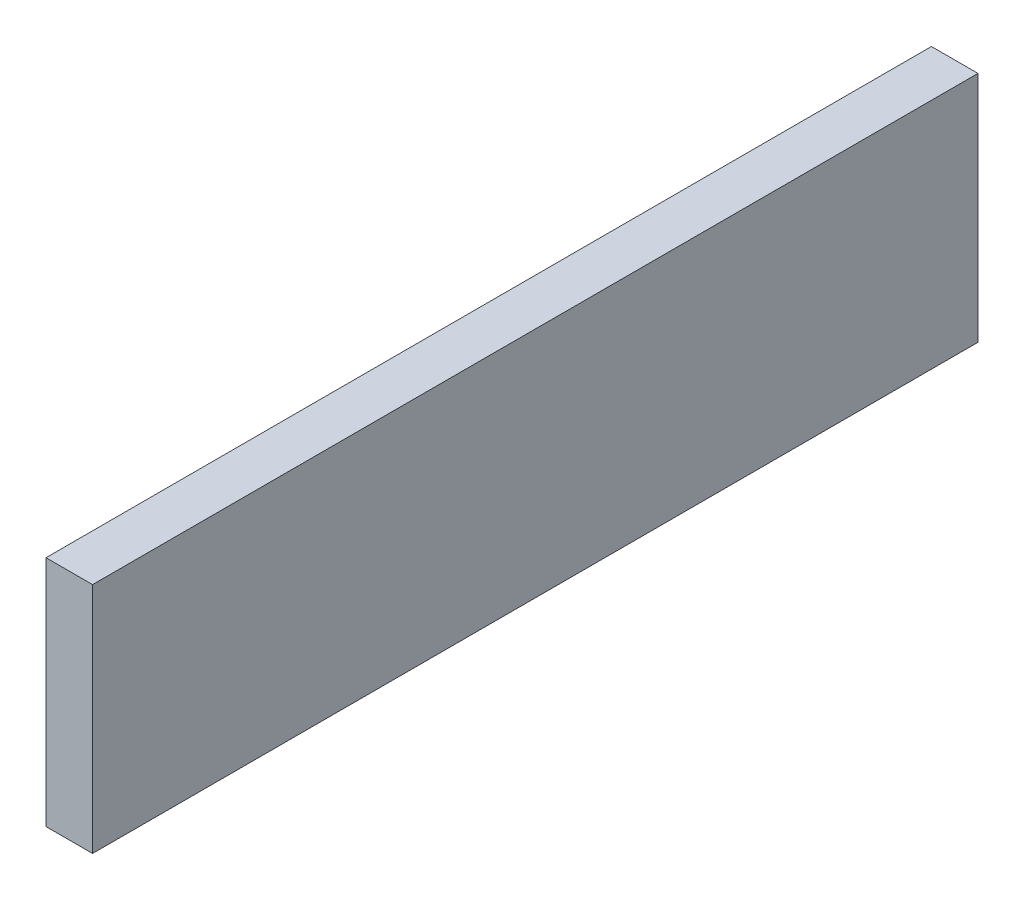
ISO-10303-21;
HEADER;
FILE_DESCRIPTION(('STEP AP214'),'2;1');
FILE_NAME('part.step','',(''),(''),'','','');
FILE_SCHEMA(('AUTOMOTIVE_DESIGN { 1 0 10303 214 1 1 1 1 }'));
ENDSEC;
DATA;
#1=APPLICATION_CONTEXT('core data for automotive mechanical design processes');
#2=APPLICATION_PROTOCOL_DEFINITION('international standard','automotive_design',2000,#1);
#3=PRODUCT_CONTEXT('',#1,'mechanical');
#4=PRODUCT('Part','Part','',(#3));
#5=PRODUCT_RELATED_PRODUCT_CATEGORY('part','',(#4));
#6=PRODUCT_DEFINITION_FORMATION('','',#4);
#7=PRODUCT_DEFINITION_CONTEXT('part definition',#1,'design');
#8=PRODUCT_DEFINITION('design','',#6,#7);
#9=PRODUCT_DEFINITION_SHAPE('','',#8);
#10=(LENGTH_UNIT() NAMED_UNIT(*) SI_UNIT(.MILLI.,.METRE.));
#11=(NAMED_UNIT(*) PLANE_ANGLE_UNIT() SI_UNIT($,.RADIAN.));
#12=(NAMED_UNIT(*) SI_UNIT($,.STERADIAN.) SOLID_ANGLE_UNIT());
#13=UNCERTAINTY_MEASURE_WITH_UNIT(LENGTH_MEASURE(1.E-05),#10,'distance_accuracy_value','');
#14=(GEOMETRIC_REPRESENTATION_CONTEXT(3) GLOBAL_UNCERTAINTY_ASSIGNED_CONTEXT((#13)) GLOBAL_UNIT_ASSIGNED_CONTEXT((#10,
#11,#12)) REPRESENTATION_CONTEXT('',''));
#15=CARTESIAN_POINT('',(0.,0.,0.));
#16=DIRECTION('',(0.,0.,1.));
#17=DIRECTION('',(1.,0.,0.));
#18=AXIS2_PLACEMENT_3D('',#15,#16,#17);
#19=CARTESIAN_POINT('',(315.6,0.,-3000.));
#20=DIRECTION('',(-1.,0.,0.));
#21=DIRECTION('',(0.,0.,1.));
#22=AXIS2_PLACEMENT_3D('',#19,#20,#21);
#23=PLANE('',#22);
#24=DIRECTION('',(0.,-1.,0.));
#25=VECTOR('',#24,1.);
#26=CARTESIAN_POINT('',(315.6,0.,0.));
#27=LINE('',#26,#25);
#28=CARTESIAN_POINT('',(315.6,789.,0.));
#29=VERTEX_POINT('',#28);
#30=CARTESIAN_POINT('',(315.6,0.,0.));
#31=VERTEX_POINT('',#30);
#32=EDGE_CURVE('E66',#29,#31,#27,.T.);
#33=ORIENTED_EDGE('',*,*,#32,.F.);
#34=DIRECTION('',(0.,0.,1.));
#35=VECTOR('',#34,1.);
#36=CARTESIAN_POINT('',(315.6,789.,-3000.));
#37=LINE('',#36,#35);
#38=CARTESIAN_POINT('',(315.6,789.,-3000.));
#39=VERTEX_POINT('',#38);
#40=EDGE_CURVE('E11',#39,#29,#37,.T.);
#41=ORIENTED_EDGE('',*,*,#40,.F.);
#42=DIRECTION('',(0.,-1.,0.));
#43=VECTOR('',#42,1.);
#44=CARTESIAN_POINT('',(315.6,0.,-3000.));
#45=LINE('',#44,#43);
#46=CARTESIAN_POINT('',(315.6,0.,-3000.));
#47=VERTEX_POINT('',#46);
#48=EDGE_CURVE('E68',#39,#47,#45,.T.);
#49=ORIENTED_EDGE('',*,*,#48,.T.);
#50=DIRECTION('',(0.,0.,1.));
#51=VECTOR('',#50,1.);
#52=CARTESIAN_POINT('',(315.6,0.,-3000.));
#53=LINE('',#52,#51);
#54=EDGE_CURVE('E29',#47,#31,#53,.T.);
#55=ORIENTED_EDGE('',*,*,#54,.T.);
#56=EDGE_LOOP('',(#33,#41,#49,#55));
#57=FACE_BOUND('',#56,.T.);
#58=ADVANCED_FACE('F26',(#57),#23,.T.);
#59=CARTESIAN_POINT('',(315.6,789.,-3000.));
#60=DIRECTION('',(0.,1.,0.));
#61=DIRECTION('',(0.,0.,1.));
#62=AXIS2_PLACEMENT_3D('',#59,#60,#61);
#63=PLANE('',#62);
#64=DIRECTION('',(-1.,0.,0.));
#65=VECTOR('',#64,1.);
#66=CARTESIAN_POINT('',(315.6,789.,0.));
#67=LINE('',#66,#65);
#68=CARTESIAN_POINT('',(473.4,789.,0.));
#69=VERTEX_POINT('',#68);
#70=EDGE_CURVE('E83',#69,#29,#67,.T.);
#71=ORIENTED_EDGE('',*,*,#70,.F.);
#72=DIRECTION('',(0.,0.,1.));
#73=VECTOR('',#72,1.);
#74=CARTESIAN_POINT('',(473.4,789.,-3000.));
#75=LINE('',#74,#73);
#76=CARTESIAN_POINT('',(473.4,789.,-3000.));
#77=VERTEX_POINT('',#76);
#78=EDGE_CURVE('E34',#77,#69,#75,.T.);
#79=ORIENTED_EDGE('',*,*,#78,.F.);
#80=DIRECTION('',(-1.,0.,0.));
#81=VECTOR('',#80,1.);
#82=CARTESIAN_POINT('',(315.6,789.,-3000.));
#83=LINE('',#82,#81);
#84=EDGE_CURVE('E73',#77,#39,#83,.T.);
#85=ORIENTED_EDGE('',*,*,#84,.T.);
#86=ORIENTED_EDGE('',*,*,#40,.T.);
#87=EDGE_LOOP('',(#71,#79,#85,#86));
#88=FACE_BOUND('',#87,.T.);
#89=ADVANCED_FACE('F98',(#88),#63,.T.);
#90=CARTESIAN_POINT('',(473.4,0.,-3000.));
#91=DIRECTION('',(1.,0.,0.));
#92=DIRECTION('',(0.,0.,-1.));
#93=AXIS2_PLACEMENT_3D('',#90,#91,#92);
#94=PLANE('',#93);
#95=DIRECTION('',(0.,1.,0.));
#96=VECTOR('',#95,1.);
#97=CARTESIAN_POINT('',(473.4,0.,0.));
#98=LINE('',#97,#96);
#99=CARTESIAN_POINT('',(473.4,0.,0.));
#100=VERTEX_POINT('',#99);
#101=EDGE_CURVE('E80',#100,#69,#98,.T.);
#102=ORIENTED_EDGE('',*,*,#101,.F.);
#103=DIRECTION('',(0.,0.,1.));
#104=VECTOR('',#103,1.);
#105=CARTESIAN_POINT('',(473.4,0.,-3000.));
#106=LINE('',#105,#104);
#107=CARTESIAN_POINT('',(473.4,0.,-3000.));
#108=VERTEX_POINT('',#107);
#109=EDGE_CURVE('E72',#108,#100,#106,.T.);
#110=ORIENTED_EDGE('',*,*,#109,.F.);
#111=DIRECTION('',(0.,1.,0.));
#112=VECTOR('',#111,1.);
#113=CARTESIAN_POINT('',(473.4,0.,-3000.));
#114=LINE('',#113,#112);
#115=EDGE_CURVE('E91',#108,#77,#114,.T.);
#116=ORIENTED_EDGE('',*,*,#115,.T.);
#117=ORIENTED_EDGE('',*,*,#78,.T.);
#118=EDGE_LOOP('',(#102,#110,#116,#117));
#119=FACE_BOUND('',#118,.T.);
#120=ADVANCED_FACE('F95',(#119),#94,.T.);
#121=CARTESIAN_POINT('',(315.6,0.,-3000.));
#122=DIRECTION('',(0.,-1.,0.));
#123=DIRECTION('',(0.,0.,-1.));
#124=AXIS2_PLACEMENT_3D('',#121,#122,#123);
#125=PLANE('',#124);
#126=DIRECTION('',(1.,0.,0.));
#127=VECTOR('',#126,1.);
#128=CARTESIAN_POINT('',(315.6,0.,0.));
#129=LINE('',#128,#127);
#130=EDGE_CURVE('E75',#31,#100,#129,.T.);
#131=ORIENTED_EDGE('',*,*,#130,.F.);
#132=ORIENTED_EDGE('',*,*,#54,.F.);
#133=DIRECTION('',(1.,0.,0.));
#134=VECTOR('',#133,1.);
#135=CARTESIAN_POINT('',(315.6,0.,-3000.));
#136=LINE('',#135,#134);
#137=EDGE_CURVE('E89',#47,#108,#136,.T.);
#138=ORIENTED_EDGE('',*,*,#137,.T.);
#139=ORIENTED_EDGE('',*,*,#109,.T.);
#140=EDGE_LOOP('',(#131,#132,#138,#139));
#141=FACE_BOUND('',#140,.T.);
#142=ADVANCED_FACE('F76',(#141),#125,.T.);
#143=CARTESIAN_POINT('',(315.6,789.,-3000.));
#144=DIRECTION('',(0.,0.,-1.));
#145=DIRECTION('',(-1.,0.,0.));
#146=AXIS2_PLACEMENT_3D('',#143,#144,#145);
#147=PLANE('',#146);
#148=ORIENTED_EDGE('',*,*,#48,.F.);
#149=ORIENTED_EDGE('',*,*,#84,.F.);
#150=ORIENTED_EDGE('',*,*,#115,.F.);
#151=ORIENTED_EDGE('',*,*,#137,.F.);
#152=EDGE_LOOP('',(#148,#149,#150,#151));
#153=FACE_BOUND('',#152,.T.);
#154=ADVANCED_FACE('F100',(#153),#147,.T.);
#155=CARTESIAN_POINT('',(315.6,789.,0.));
#156=DIRECTION('',(0.,0.,-1.));
#157=DIRECTION('',(-1.,0.,0.));
#158=AXIS2_PLACEMENT_3D('',#155,#156,#157);
#159=PLANE('',#158);
#160=ORIENTED_EDGE('',*,*,#32,.T.);
#161=ORIENTED_EDGE('',*,*,#130,.T.);
#162=ORIENTED_EDGE('',*,*,#101,.T.);
#163=ORIENTED_EDGE('',*,*,#70,.T.);
#164=EDGE_LOOP('',(#160,#161,#162,#163));
#165=FACE_BOUND('',#164,.T.);
#166=ADVANCED_FACE('F82',(#165),#159,.F.);
#167=CLOSED_SHELL('',(#58,#89,#120,#142,#154,#166));
#168=MANIFOLD_SOLID_BREP('B2',#167);
#169=ADVANCED_BREP_SHAPE_REPRESENTATION('',(#18,#168),#14);
#170=SHAPE_DEFINITION_REPRESENTATION(#9,#169);
ENDSEC;
END-ISO-10303-21;
